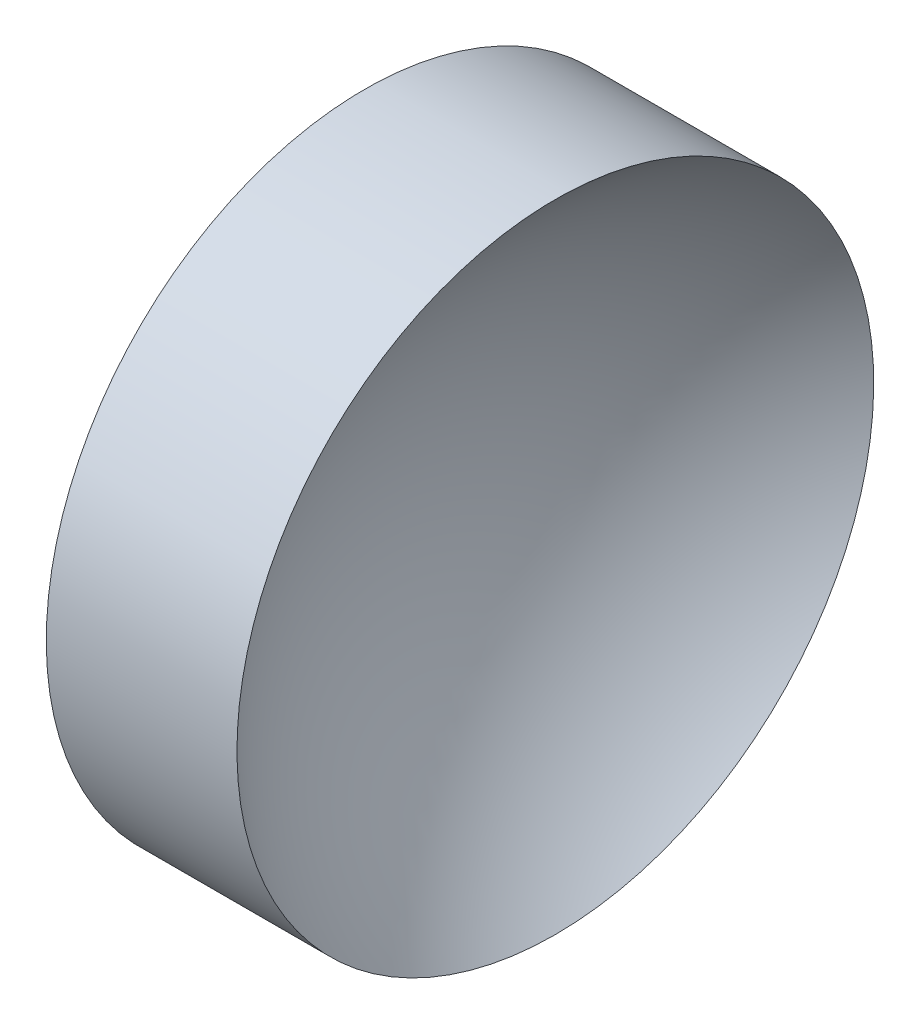
ISO-10303-21;
HEADER;
FILE_DESCRIPTION(('STEP AP214'),'2;1');
FILE_NAME('part.step','',(''),(''),'','','');
FILE_SCHEMA(('AUTOMOTIVE_DESIGN { 1 0 10303 214 1 1 1 1 }'));
ENDSEC;
DATA;
#1=APPLICATION_CONTEXT('core data for automotive mechanical design processes');
#2=APPLICATION_PROTOCOL_DEFINITION('international standard','automotive_design',2000,#1);
#3=PRODUCT_CONTEXT('',#1,'mechanical');
#4=PRODUCT('Part','Part','',(#3));
#5=PRODUCT_RELATED_PRODUCT_CATEGORY('part','',(#4));
#6=PRODUCT_DEFINITION_FORMATION('','',#4);
#7=PRODUCT_DEFINITION_CONTEXT('part definition',#1,'design');
#8=PRODUCT_DEFINITION('design','',#6,#7);
#9=PRODUCT_DEFINITION_SHAPE('','',#8);
#10=(LENGTH_UNIT() NAMED_UNIT(*) SI_UNIT(.MILLI.,.METRE.));
#11=(NAMED_UNIT(*) PLANE_ANGLE_UNIT() SI_UNIT($,.RADIAN.));
#12=(NAMED_UNIT(*) SI_UNIT($,.STERADIAN.) SOLID_ANGLE_UNIT());
#13=UNCERTAINTY_MEASURE_WITH_UNIT(LENGTH_MEASURE(1.E-05),#10,'distance_accuracy_value','');
#14=(GEOMETRIC_REPRESENTATION_CONTEXT(3) GLOBAL_UNCERTAINTY_ASSIGNED_CONTEXT((#13)) GLOBAL_UNIT_ASSIGNED_CONTEXT((#10,
#11,#12)) REPRESENTATION_CONTEXT('',''));
#15=CARTESIAN_POINT('',(0.,0.,0.));
#16=DIRECTION('',(0.,0.,1.));
#17=DIRECTION('',(1.,0.,0.));
#18=AXIS2_PLACEMENT_3D('',#15,#16,#17);
#19=CARTESIAN_POINT('',(143.315447260186,65.1574518265862,0.));
#20=DIRECTION('',(-1.,0.,0.));
#21=DIRECTION('',(0.,-1.,0.));
#22=AXIS2_PLACEMENT_3D('',#19,#20,#21);
#23=SPHERICAL_SURFACE('',#22,25.84);
#24=CARTESIAN_POINT('',(126.953735858258,65.1574518265862,0.));
#25=DIRECTION('',(-1.,0.,0.));
#26=DIRECTION('',(0.,-1.,0.));
#27=AXIS2_PLACEMENT_3D('',#24,#25,#26);
#28=CIRCLE('',#27,20.);
#29=CARTESIAN_POINT('',(126.953735858258,45.1574518265862,0.));
#30=VERTEX_POINT('',#29);
#31=EDGE_CURVE('E10',#30,#30,#28,.T.);
#32=ORIENTED_EDGE('',*,*,#31,.F.);
#33=EDGE_LOOP('',(#32));
#34=FACE_BOUND('',#33,.T.);
#35=ADVANCED_FACE('F35',(#34),#23,.F.);
#36=CARTESIAN_POINT('',(110.014789248842,65.1574518265862,0.));
#37=DIRECTION('',(-1.,0.,0.));
#38=DIRECTION('',(0.,-1.,0.));
#39=AXIS2_PLACEMENT_3D('',#36,#37,#38);
#40=CYLINDRICAL_SURFACE('',#39,20.);
#41=CARTESIAN_POINT('',(114.975447260186,65.1574518265862,0.));
#42=DIRECTION('',(-1.,0.,0.));
#43=DIRECTION('',(0.,-1.,0.));
#44=AXIS2_PLACEMENT_3D('',#41,#42,#43);
#45=CIRCLE('',#44,20.);
#46=CARTESIAN_POINT('',(114.975447260186,45.1574518265862,0.));
#47=VERTEX_POINT('',#46);
#48=EDGE_CURVE('E41',#47,#47,#45,.T.);
#49=ORIENTED_EDGE('',*,*,#48,.F.);
#50=EDGE_LOOP('',(#49));
#51=FACE_BOUND('',#50,.T.);
#52=ORIENTED_EDGE('',*,*,#31,.T.);
#53=EDGE_LOOP('',(#52));
#54=FACE_BOUND('',#53,.T.);
#55=ADVANCED_FACE('F49',(#51,#54),#40,.T.);
#56=CARTESIAN_POINT('',(114.975447260186,65.1574518265862,0.));
#57=DIRECTION('',(1.,0.,0.));
#58=DIRECTION('',(0.,1.,0.));
#59=AXIS2_PLACEMENT_3D('',#56,#57,#58);
#60=PLANE('',#59);
#61=ORIENTED_EDGE('',*,*,#48,.T.);
#62=EDGE_LOOP('',(#61));
#63=FACE_BOUND('',#62,.T.);
#64=ADVANCED_FACE('F47',(#63),#60,.F.);
#65=CLOSED_SHELL('',(#35,#55,#64));
#66=MANIFOLD_SOLID_BREP('B2',#65);
#67=ADVANCED_BREP_SHAPE_REPRESENTATION('',(#18,#66),#14);
#68=SHAPE_DEFINITION_REPRESENTATION(#9,#67);
ENDSEC;
END-ISO-10303-21;
